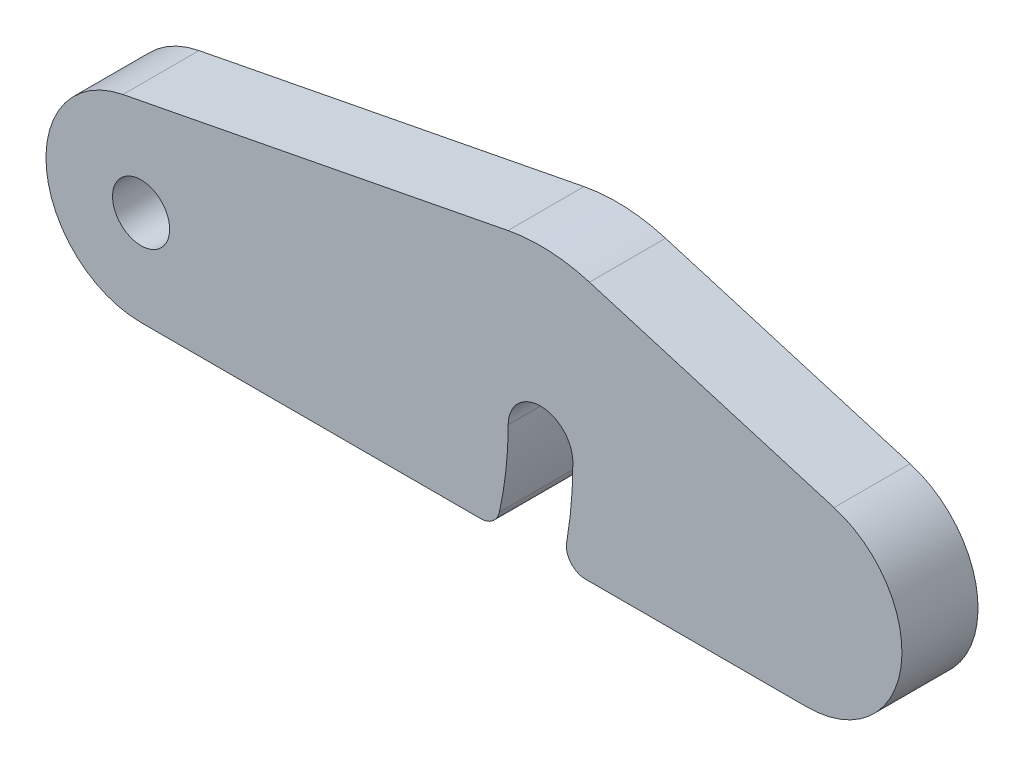
ISO-10303-21;
HEADER;
FILE_DESCRIPTION(('STEP AP214'),'2;1');
FILE_NAME('part.step','',(''),(''),'','','');
FILE_SCHEMA(('AUTOMOTIVE_DESIGN { 1 0 10303 214 1 1 1 1 }'));
ENDSEC;
DATA;
#1=APPLICATION_CONTEXT('core data for automotive mechanical design processes');
#2=APPLICATION_PROTOCOL_DEFINITION('international standard','automotive_design',2000,#1);
#3=PRODUCT_CONTEXT('',#1,'mechanical');
#4=PRODUCT('Part','Part','',(#3));
#5=PRODUCT_RELATED_PRODUCT_CATEGORY('part','',(#4));
#6=PRODUCT_DEFINITION_FORMATION('','',#4);
#7=PRODUCT_DEFINITION_CONTEXT('part definition',#1,'design');
#8=PRODUCT_DEFINITION('design','',#6,#7);
#9=PRODUCT_DEFINITION_SHAPE('','',#8);
#10=(LENGTH_UNIT() NAMED_UNIT(*) SI_UNIT(.MILLI.,.METRE.));
#11=(NAMED_UNIT(*) PLANE_ANGLE_UNIT() SI_UNIT($,.RADIAN.));
#12=(NAMED_UNIT(*) SI_UNIT($,.STERADIAN.) SOLID_ANGLE_UNIT());
#13=UNCERTAINTY_MEASURE_WITH_UNIT(LENGTH_MEASURE(1.E-05),#10,'distance_accuracy_value','');
#14=(GEOMETRIC_REPRESENTATION_CONTEXT(3) GLOBAL_UNCERTAINTY_ASSIGNED_CONTEXT((#13)) GLOBAL_UNIT_ASSIGNED_CONTEXT((#10,
#11,#12)) REPRESENTATION_CONTEXT('',''));
#15=CARTESIAN_POINT('',(0.,0.,0.));
#16=DIRECTION('',(0.,0.,1.));
#17=DIRECTION('',(1.,0.,0.));
#18=AXIS2_PLACEMENT_3D('',#15,#16,#17);
#19=CARTESIAN_POINT('',(-17.9761904761905,2.45422953905805,4.));
#20=DIRECTION('',(0.,0.,1.));
#21=DIRECTION('',(1.,0.,0.));
#22=AXIS2_PLACEMENT_3D('',#19,#20,#21);
#23=PLANE('',#22);
#24=CARTESIAN_POINT('',(-17.9761904761905,2.45422953905805,4.));
#25=DIRECTION('',(0.,0.,1.));
#26=DIRECTION('',(1.,0.,0.));
#27=AXIS2_PLACEMENT_3D('',#24,#25,#26);
#28=CIRCLE('',#27,1.5);
#29=CARTESIAN_POINT('',(-16.4761904761905,2.45422953905805,4.));
#30=VERTEX_POINT('',#29);
#31=EDGE_CURVE('E155',#30,#30,#28,.T.);
#32=ORIENTED_EDGE('',*,*,#31,.F.);
#33=EDGE_LOOP('',(#32));
#34=FACE_BOUND('',#33,.T.);
#35=CARTESIAN_POINT('',(-17.9761904761905,2.45422953905805,4.));
#36=DIRECTION('',(0.,0.,1.));
#37=DIRECTION('',(1.,0.,0.));
#38=AXIS2_PLACEMENT_3D('',#35,#36,#37);
#39=CIRCLE('',#38,22.7);
#40=CARTESIAN_POINT('',(4.39816371576224,-1.37699408963399,4.));
#41=VERTEX_POINT('',#40);
#42=CARTESIAN_POINT('',(4.72380952380953,2.45422953905805,4.));
#43=VERTEX_POINT('',#42);
#44=EDGE_CURVE('E142',#41,#43,#39,.T.);
#45=ORIENTED_EDGE('',*,*,#44,.F.);
#46=CARTESIAN_POINT('',(5.38381808545179,-1.545770460942,4.));
#47=DIRECTION('',(0.,0.,1.));
#48=DIRECTION('',(1.,0.,0.));
#49=AXIS2_PLACEMENT_3D('',#46,#47,#48);
#50=CIRCLE('',#49,1.);
#51=CARTESIAN_POINT('',(5.38381808545178,-2.545770460942,4.));
#52=VERTEX_POINT('',#51);
#53=EDGE_CURVE('E216',#41,#52,#50,.T.);
#54=ORIENTED_EDGE('',*,*,#53,.T.);
#55=DIRECTION('',(1.,0.,0.));
#56=VECTOR('',#55,1.);
#57=CARTESIAN_POINT('',(-17.9761904761905,-2.54577046094195,4.));
#58=LINE('',#57,#56);
#59=CARTESIAN_POINT('',(17.0238095238095,-2.54577046094203,4.));
#60=VERTEX_POINT('',#59);
#61=EDGE_CURVE('E164',#52,#60,#58,.T.);
#62=ORIENTED_EDGE('',*,*,#61,.T.);
#63=CARTESIAN_POINT('',(17.0238095238095,2.45422953905805,4.));
#64=DIRECTION('',(0.,0.,1.));
#65=DIRECTION('',(1.,0.,0.));
#66=AXIS2_PLACEMENT_3D('',#63,#64,#65);
#67=CIRCLE('',#66,5.00000000000008);
#68=CARTESIAN_POINT('',(18.452380952381,7.24580377655768,4.));
#69=VERTEX_POINT('',#68);
#70=EDGE_CURVE('E168',#60,#69,#67,.T.);
#71=ORIENTED_EDGE('',*,*,#70,.T.);
#72=DIRECTION('',(-0.95831484749991,0.285714285714286,0.));
#73=VECTOR('',#72,1.);
#74=CARTESIAN_POINT('',(18.452380952381,7.24580377655768,4.));
#75=LINE('',#74,#73);
#76=CARTESIAN_POINT('',(5.59523809523812,11.0790631665573,4.));
#77=VERTEX_POINT('',#76);
#78=EDGE_CURVE('E170',#69,#77,#75,.T.);
#79=ORIENTED_EDGE('',*,*,#78,.T.);
#80=CARTESIAN_POINT('',(3.02380952380953,2.45422953905805,4.));
#81=DIRECTION('',(0.,0.,1.));
#82=DIRECTION('',(1.,0.,0.));
#83=AXIS2_PLACEMENT_3D('',#80,#81,#82);
#84=CIRCLE('',#83,9.00000000000008);
#85=CARTESIAN_POINT('',(1.30952380952377,11.2894558796674,4.));
#86=VERTEX_POINT('',#85);
#87=EDGE_CURVE('E172',#77,#86,#84,.T.);
#88=ORIENTED_EDGE('',*,*,#87,.T.);
#89=DIRECTION('',(-0.981691815623252,-0.190476190476194,0.));
#90=VECTOR('',#89,1.);
#91=CARTESIAN_POINT('',(-18.9285714285714,7.36268861717431,4.));
#92=LINE('',#91,#90);
#93=CARTESIAN_POINT('',(-18.9285714285714,7.36268861717431,4.));
#94=VERTEX_POINT('',#93);
#95=EDGE_CURVE('E174',#86,#94,#92,.T.);
#96=ORIENTED_EDGE('',*,*,#95,.T.);
#97=CARTESIAN_POINT('',(-17.9761904761905,2.45422953905805,4.));
#98=DIRECTION('',(0.,0.,1.));
#99=DIRECTION('',(1.,0.,0.));
#100=AXIS2_PLACEMENT_3D('',#97,#98,#99);
#101=CIRCLE('',#100,5.);
#102=CARTESIAN_POINT('',(-17.9761904761905,-2.54577046094195,4.));
#103=VERTEX_POINT('',#102);
#104=EDGE_CURVE('E161',#94,#103,#101,.T.);
#105=ORIENTED_EDGE('',*,*,#104,.T.);
#106=CARTESIAN_POINT('',(-0.118699051021048,-2.54577046094199,4.));
#107=VERTEX_POINT('',#106);
#108=EDGE_CURVE('E166',#103,#107,#58,.T.);
#109=ORIENTED_EDGE('',*,*,#108,.T.);
#110=CARTESIAN_POINT('',(-0.118699051021045,-1.54577046094199,4.));
#111=DIRECTION('',(0.,0.,1.));
#112=DIRECTION('',(1.,0.,0.));
#113=AXIS2_PLACEMENT_3D('',#110,#111,#112);
#114=CIRCLE('',#113,1.);
#115=CARTESIAN_POINT('',(0.857120152540129,-1.76434969591467,4.));
#116=VERTEX_POINT('',#115);
#117=EDGE_CURVE('E51',#107,#116,#114,.T.);
#118=ORIENTED_EDGE('',*,*,#117,.T.);
#119=CARTESIAN_POINT('',(-17.9761904761905,2.45422953905805,4.));
#120=DIRECTION('',(0.,0.,-1.));
#121=DIRECTION('',(1.,0.,0.));
#122=AXIS2_PLACEMENT_3D('',#119,#120,#121);
#123=CIRCLE('',#122,19.3);
#124=CARTESIAN_POINT('',(1.32380952380953,2.45422953905805,4.));
#125=VERTEX_POINT('',#124);
#126=EDGE_CURVE('E231',#125,#116,#123,.T.);
#127=ORIENTED_EDGE('',*,*,#126,.F.);
#128=CARTESIAN_POINT('',(3.02380952380953,2.45422953905805,4.));
#129=DIRECTION('',(0.,0.,1.));
#130=DIRECTION('',(1.,0.,0.));
#131=AXIS2_PLACEMENT_3D('',#128,#129,#130);
#132=CIRCLE('',#131,1.7);
#133=EDGE_CURVE('E149',#43,#125,#132,.T.);
#134=ORIENTED_EDGE('',*,*,#133,.F.);
#135=EDGE_LOOP('',(#45,#54,#62,#71,#79,#88,#96,#105,#109,#118,#127,#134));
#136=FACE_BOUND('',#135,.T.);
#137=ADVANCED_FACE('F36',(#34,#136),#23,.T.);
#138=CARTESIAN_POINT('',(-17.9761904761905,2.45422953905805,0.));
#139=DIRECTION('',(0.,0.,1.));
#140=DIRECTION('',(1.,0.,0.));
#141=AXIS2_PLACEMENT_3D('',#138,#139,#140);
#142=PLANE('',#141);
#143=CARTESIAN_POINT('',(-17.9761904761905,2.45422953905805,0.));
#144=DIRECTION('',(0.,0.,1.));
#145=DIRECTION('',(1.,0.,0.));
#146=AXIS2_PLACEMENT_3D('',#143,#144,#145);
#147=CIRCLE('',#146,1.5);
#148=CARTESIAN_POINT('',(-16.4761904761905,2.45422953905805,0.));
#149=VERTEX_POINT('',#148);
#150=EDGE_CURVE('E151',#149,#149,#147,.T.);
#151=ORIENTED_EDGE('',*,*,#150,.T.);
#152=EDGE_LOOP('',(#151));
#153=FACE_BOUND('',#152,.T.);
#154=DIRECTION('',(1.,0.,0.));
#155=VECTOR('',#154,1.);
#156=CARTESIAN_POINT('',(-17.9761904761905,-2.54577046094195,0.));
#157=LINE('',#156,#155);
#158=CARTESIAN_POINT('',(5.38381808545178,-2.545770460942,0.));
#159=VERTEX_POINT('',#158);
#160=CARTESIAN_POINT('',(17.0238095238095,-2.54577046094203,0.));
#161=VERTEX_POINT('',#160);
#162=EDGE_CURVE('E179',#159,#161,#157,.T.);
#163=ORIENTED_EDGE('',*,*,#162,.F.);
#164=CARTESIAN_POINT('',(5.38381808545179,-1.545770460942,0.));
#165=DIRECTION('',(0.,0.,1.));
#166=DIRECTION('',(1.,0.,0.));
#167=AXIS2_PLACEMENT_3D('',#164,#165,#166);
#168=CIRCLE('',#167,1.);
#169=CARTESIAN_POINT('',(4.39816371576224,-1.37699408963399,0.));
#170=VERTEX_POINT('',#169);
#171=EDGE_CURVE('E132',#159,#170,#168,.F.);
#172=ORIENTED_EDGE('',*,*,#171,.T.);
#173=CARTESIAN_POINT('',(-17.9761904761905,2.45422953905805,0.));
#174=DIRECTION('',(0.,0.,1.));
#175=DIRECTION('',(1.,0.,0.));
#176=AXIS2_PLACEMENT_3D('',#173,#174,#175);
#177=CIRCLE('',#176,22.7);
#178=CARTESIAN_POINT('',(4.72380952380953,2.45422953905805,0.));
#179=VERTEX_POINT('',#178);
#180=EDGE_CURVE('E125',#170,#179,#177,.T.);
#181=ORIENTED_EDGE('',*,*,#180,.T.);
#182=CARTESIAN_POINT('',(3.02380952380953,2.45422953905805,0.));
#183=DIRECTION('',(0.,0.,1.));
#184=DIRECTION('',(1.,0.,0.));
#185=AXIS2_PLACEMENT_3D('',#182,#183,#184);
#186=CIRCLE('',#185,1.7);
#187=CARTESIAN_POINT('',(1.32380952380953,2.45422953905805,0.));
#188=VERTEX_POINT('',#187);
#189=EDGE_CURVE('E131',#179,#188,#186,.T.);
#190=ORIENTED_EDGE('',*,*,#189,.T.);
#191=CARTESIAN_POINT('',(-17.9761904761905,2.45422953905805,0.));
#192=DIRECTION('',(0.,0.,-1.));
#193=DIRECTION('',(1.,0.,0.));
#194=AXIS2_PLACEMENT_3D('',#191,#192,#193);
#195=CIRCLE('',#194,19.3);
#196=CARTESIAN_POINT('',(0.857120152540129,-1.76434969591467,0.));
#197=VERTEX_POINT('',#196);
#198=EDGE_CURVE('E136',#188,#197,#195,.T.);
#199=ORIENTED_EDGE('',*,*,#198,.T.);
#200=CARTESIAN_POINT('',(-0.118699051021045,-1.54577046094199,0.));
#201=DIRECTION('',(0.,0.,1.));
#202=DIRECTION('',(1.,0.,0.));
#203=AXIS2_PLACEMENT_3D('',#200,#201,#202);
#204=CIRCLE('',#203,1.);
#205=CARTESIAN_POINT('',(-0.118699051021048,-2.54577046094199,0.));
#206=VERTEX_POINT('',#205);
#207=EDGE_CURVE('E210',#197,#206,#204,.F.);
#208=ORIENTED_EDGE('',*,*,#207,.T.);
#209=CARTESIAN_POINT('',(-17.9761904761905,-2.54577046094195,0.));
#210=VERTEX_POINT('',#209);
#211=EDGE_CURVE('E180',#210,#206,#157,.T.);
#212=ORIENTED_EDGE('',*,*,#211,.F.);
#213=CARTESIAN_POINT('',(-17.9761904761905,2.45422953905805,0.));
#214=DIRECTION('',(0.,0.,1.));
#215=DIRECTION('',(1.,0.,0.));
#216=AXIS2_PLACEMENT_3D('',#213,#214,#215);
#217=CIRCLE('',#216,5.);
#218=CARTESIAN_POINT('',(-18.9285714285714,7.36268861717431,0.));
#219=VERTEX_POINT('',#218);
#220=EDGE_CURVE('E158',#219,#210,#217,.T.);
#221=ORIENTED_EDGE('',*,*,#220,.F.);
#222=DIRECTION('',(-0.981691815623252,-0.190476190476194,0.));
#223=VECTOR('',#222,1.);
#224=CARTESIAN_POINT('',(-18.9285714285714,7.36268861717431,0.));
#225=LINE('',#224,#223);
#226=CARTESIAN_POINT('',(1.30952380952377,11.2894558796674,0.));
#227=VERTEX_POINT('',#226);
#228=EDGE_CURVE('E165',#227,#219,#225,.T.);
#229=ORIENTED_EDGE('',*,*,#228,.F.);
#230=CARTESIAN_POINT('',(3.02380952380953,2.45422953905805,0.));
#231=DIRECTION('',(0.,0.,1.));
#232=DIRECTION('',(1.,0.,0.));
#233=AXIS2_PLACEMENT_3D('',#230,#231,#232);
#234=CIRCLE('',#233,9.00000000000008);
#235=CARTESIAN_POINT('',(5.59523809523812,11.0790631665573,0.));
#236=VERTEX_POINT('',#235);
#237=EDGE_CURVE('E187',#236,#227,#234,.T.);
#238=ORIENTED_EDGE('',*,*,#237,.F.);
#239=DIRECTION('',(-0.95831484749991,0.285714285714286,0.));
#240=VECTOR('',#239,1.);
#241=CARTESIAN_POINT('',(18.452380952381,7.24580377655768,0.));
#242=LINE('',#241,#240);
#243=CARTESIAN_POINT('',(18.452380952381,7.24580377655768,0.));
#244=VERTEX_POINT('',#243);
#245=EDGE_CURVE('E185',#244,#236,#242,.T.);
#246=ORIENTED_EDGE('',*,*,#245,.F.);
#247=CARTESIAN_POINT('',(17.0238095238095,2.45422953905805,0.));
#248=DIRECTION('',(0.,0.,1.));
#249=DIRECTION('',(1.,0.,0.));
#250=AXIS2_PLACEMENT_3D('',#247,#248,#249);
#251=CIRCLE('',#250,5.00000000000008);
#252=EDGE_CURVE('E183',#161,#244,#251,.T.);
#253=ORIENTED_EDGE('',*,*,#252,.F.);
#254=EDGE_LOOP('',(#163,#172,#181,#190,#199,#208,#212,#221,#229,#238,#246,#253));
#255=FACE_BOUND('',#254,.T.);
#256=ADVANCED_FACE('F128',(#153,#255),#142,.F.);
#257=CARTESIAN_POINT('',(-17.9761904761905,-2.54577046094195,4.));
#258=DIRECTION('',(0.,1.,0.));
#259=DIRECTION('',(-1.,0.,0.));
#260=AXIS2_PLACEMENT_3D('',#257,#258,#259);
#261=PLANE('',#260);
#262=ORIENTED_EDGE('',*,*,#61,.F.);
#263=DIRECTION('',(0.,0.,1.));
#264=VECTOR('',#263,1.);
#265=CARTESIAN_POINT('',(5.38381808545178,-2.545770460942,4.));
#266=LINE('',#265,#264);
#267=EDGE_CURVE('E207',#52,#159,#266,.F.);
#268=ORIENTED_EDGE('',*,*,#267,.T.);
#269=ORIENTED_EDGE('',*,*,#162,.T.);
#270=DIRECTION('',(0.,0.,-1.));
#271=VECTOR('',#270,1.);
#272=CARTESIAN_POINT('',(17.0238095238095,-2.54577046094203,4.));
#273=LINE('',#272,#271);
#274=EDGE_CURVE('E201',#60,#161,#273,.T.);
#275=ORIENTED_EDGE('',*,*,#274,.F.);
#276=EDGE_LOOP('',(#262,#268,#269,#275));
#277=FACE_BOUND('',#276,.T.);
#278=ADVANCED_FACE('F241',(#277),#261,.F.);
#279=CARTESIAN_POINT('',(3.02380952380953,2.45422953905805,4.));
#280=DIRECTION('',(0.,0.,-1.));
#281=DIRECTION('',(-1.,0.,0.));
#282=AXIS2_PLACEMENT_3D('',#279,#280,#281);
#283=CYLINDRICAL_SURFACE('',#282,1.7);
#284=ORIENTED_EDGE('',*,*,#189,.F.);
#285=DIRECTION('',(0.,0.,1.));
#286=VECTOR('',#285,1.);
#287=CARTESIAN_POINT('',(4.72380952380953,2.45422953905805,0.));
#288=LINE('',#287,#286);
#289=EDGE_CURVE('E139',#179,#43,#288,.T.);
#290=ORIENTED_EDGE('',*,*,#289,.T.);
#291=ORIENTED_EDGE('',*,*,#133,.T.);
#292=DIRECTION('',(0.,0.,1.));
#293=VECTOR('',#292,1.);
#294=CARTESIAN_POINT('',(1.32380952380953,2.45422953905805,0.));
#295=LINE('',#294,#293);
#296=EDGE_CURVE('E135',#188,#125,#295,.T.);
#297=ORIENTED_EDGE('',*,*,#296,.F.);
#298=EDGE_LOOP('',(#284,#290,#291,#297));
#299=FACE_BOUND('',#298,.T.);
#300=ADVANCED_FACE('F148',(#299),#283,.F.);
#301=CARTESIAN_POINT('',(-17.9761904761905,2.45422953905805,4.));
#302=DIRECTION('',(0.,0.,-1.));
#303=DIRECTION('',(-1.,0.,0.));
#304=AXIS2_PLACEMENT_3D('',#301,#302,#303);
#305=CYLINDRICAL_SURFACE('',#304,5.);
#306=ORIENTED_EDGE('',*,*,#220,.T.);
#307=DIRECTION('',(0.,0.,-1.));
#308=VECTOR('',#307,1.);
#309=CARTESIAN_POINT('',(-17.9761904761905,-2.54577046094195,4.));
#310=LINE('',#309,#308);
#311=EDGE_CURVE('E204',#103,#210,#310,.T.);
#312=ORIENTED_EDGE('',*,*,#311,.F.);
#313=ORIENTED_EDGE('',*,*,#104,.F.);
#314=DIRECTION('',(0.,0.,-1.));
#315=VECTOR('',#314,1.);
#316=CARTESIAN_POINT('',(-18.9285714285714,7.36268861717431,4.));
#317=LINE('',#316,#315);
#318=EDGE_CURVE('E176',#94,#219,#317,.T.);
#319=ORIENTED_EDGE('',*,*,#318,.T.);
#320=EDGE_LOOP('',(#306,#312,#313,#319));
#321=FACE_BOUND('',#320,.T.);
#322=ADVANCED_FACE('F225',(#321),#305,.T.);
#323=ORIENTED_EDGE('',*,*,#211,.T.);
#324=DIRECTION('',(0.,0.,1.));
#325=VECTOR('',#324,1.);
#326=CARTESIAN_POINT('',(-0.118699051021048,-2.54577046094199,4.));
#327=LINE('',#326,#325);
#328=EDGE_CURVE('E44',#206,#107,#327,.T.);
#329=ORIENTED_EDGE('',*,*,#328,.T.);
#330=ORIENTED_EDGE('',*,*,#108,.F.);
#331=ORIENTED_EDGE('',*,*,#311,.T.);
#332=EDGE_LOOP('',(#323,#329,#330,#331));
#333=FACE_BOUND('',#332,.T.);
#334=ADVANCED_FACE('F218',(#333),#261,.F.);
#335=CARTESIAN_POINT('',(17.0238095238095,2.45422953905805,4.));
#336=DIRECTION('',(0.,0.,-1.));
#337=DIRECTION('',(-1.,0.,0.));
#338=AXIS2_PLACEMENT_3D('',#335,#336,#337);
#339=CYLINDRICAL_SURFACE('',#338,5.00000000000008);
#340=ORIENTED_EDGE('',*,*,#252,.T.);
#341=DIRECTION('',(0.,0.,-1.));
#342=VECTOR('',#341,1.);
#343=CARTESIAN_POINT('',(18.452380952381,7.24580377655768,4.));
#344=LINE('',#343,#342);
#345=EDGE_CURVE('E198',#69,#244,#344,.T.);
#346=ORIENTED_EDGE('',*,*,#345,.F.);
#347=ORIENTED_EDGE('',*,*,#70,.F.);
#348=ORIENTED_EDGE('',*,*,#274,.T.);
#349=EDGE_LOOP('',(#340,#346,#347,#348));
#350=FACE_BOUND('',#349,.T.);
#351=ADVANCED_FACE('F247',(#350),#339,.T.);
#352=CARTESIAN_POINT('',(18.452380952381,7.24580377655768,4.));
#353=DIRECTION('',(-0.285714285714286,-0.95831484749991,0.));
#354=DIRECTION('',(0.95831484749991,-0.285714285714286,0.));
#355=AXIS2_PLACEMENT_3D('',#352,#353,#354);
#356=PLANE('',#355);
#357=ORIENTED_EDGE('',*,*,#245,.T.);
#358=DIRECTION('',(0.,0.,-1.));
#359=VECTOR('',#358,1.);
#360=CARTESIAN_POINT('',(5.59523809523812,11.0790631665573,4.));
#361=LINE('',#360,#359);
#362=EDGE_CURVE('E195',#77,#236,#361,.T.);
#363=ORIENTED_EDGE('',*,*,#362,.F.);
#364=ORIENTED_EDGE('',*,*,#78,.F.);
#365=ORIENTED_EDGE('',*,*,#345,.T.);
#366=EDGE_LOOP('',(#357,#363,#364,#365));
#367=FACE_BOUND('',#366,.T.);
#368=ADVANCED_FACE('F251',(#367),#356,.F.);
#369=CARTESIAN_POINT('',(3.02380952380953,2.45422953905805,4.));
#370=DIRECTION('',(0.,0.,-1.));
#371=DIRECTION('',(-1.,0.,0.));
#372=AXIS2_PLACEMENT_3D('',#369,#370,#371);
#373=CYLINDRICAL_SURFACE('',#372,9.00000000000008);
#374=ORIENTED_EDGE('',*,*,#237,.T.);
#375=DIRECTION('',(0.,0.,-1.));
#376=VECTOR('',#375,1.);
#377=CARTESIAN_POINT('',(1.30952380952377,11.2894558796674,4.));
#378=LINE('',#377,#376);
#379=EDGE_CURVE('E192',#86,#227,#378,.T.);
#380=ORIENTED_EDGE('',*,*,#379,.F.);
#381=ORIENTED_EDGE('',*,*,#87,.F.);
#382=ORIENTED_EDGE('',*,*,#362,.T.);
#383=EDGE_LOOP('',(#374,#380,#381,#382));
#384=FACE_BOUND('',#383,.T.);
#385=ADVANCED_FACE('F256',(#384),#373,.T.);
#386=CARTESIAN_POINT('',(-18.9285714285714,7.36268861717431,4.));
#387=DIRECTION('',(0.190476190476194,-0.981691815623252,0.));
#388=DIRECTION('',(0.981691815623252,0.190476190476194,0.));
#389=AXIS2_PLACEMENT_3D('',#386,#387,#388);
#390=PLANE('',#389);
#391=ORIENTED_EDGE('',*,*,#228,.T.);
#392=ORIENTED_EDGE('',*,*,#318,.F.);
#393=ORIENTED_EDGE('',*,*,#95,.F.);
#394=ORIENTED_EDGE('',*,*,#379,.T.);
#395=EDGE_LOOP('',(#391,#392,#393,#394));
#396=FACE_BOUND('',#395,.T.);
#397=ADVANCED_FACE('F258',(#396),#390,.F.);
#398=CARTESIAN_POINT('',(-17.9761904761905,2.45422953905805,4.));
#399=DIRECTION('',(0.,0.,-1.));
#400=DIRECTION('',(-1.,0.,0.));
#401=AXIS2_PLACEMENT_3D('',#398,#399,#400);
#402=CYLINDRICAL_SURFACE('',#401,1.5);
#403=ORIENTED_EDGE('',*,*,#31,.T.);
#404=EDGE_LOOP('',(#403));
#405=FACE_BOUND('',#404,.T.);
#406=ORIENTED_EDGE('',*,*,#150,.F.);
#407=EDGE_LOOP('',(#406));
#408=FACE_BOUND('',#407,.T.);
#409=ADVANCED_FACE('F260',(#405,#408),#402,.F.);
#410=CARTESIAN_POINT('',(-17.9761904761905,2.45422953905805,0.));
#411=DIRECTION('',(0.,0.,1.));
#412=DIRECTION('',(1.,0.,0.));
#413=AXIS2_PLACEMENT_3D('',#410,#411,#412);
#414=CYLINDRICAL_SURFACE('',#413,19.3);
#415=ORIENTED_EDGE('',*,*,#126,.T.);
#416=DIRECTION('',(0.,0.,1.));
#417=VECTOR('',#416,1.);
#418=CARTESIAN_POINT('',(0.857120152540129,-1.76434969591467,0.));
#419=LINE('',#418,#417);
#420=EDGE_CURVE('E11',#116,#197,#419,.F.);
#421=ORIENTED_EDGE('',*,*,#420,.T.);
#422=ORIENTED_EDGE('',*,*,#198,.F.);
#423=ORIENTED_EDGE('',*,*,#296,.T.);
#424=EDGE_LOOP('',(#415,#421,#422,#423));
#425=FACE_BOUND('',#424,.T.);
#426=ADVANCED_FACE('F230',(#425),#414,.T.);
#427=CARTESIAN_POINT('',(-17.9761904761905,2.45422953905805,0.));
#428=DIRECTION('',(0.,0.,1.));
#429=DIRECTION('',(1.,0.,0.));
#430=AXIS2_PLACEMENT_3D('',#427,#428,#429);
#431=CYLINDRICAL_SURFACE('',#430,22.7);
#432=ORIENTED_EDGE('',*,*,#180,.F.);
#433=DIRECTION('',(0.,0.,1.));
#434=VECTOR('',#433,1.);
#435=CARTESIAN_POINT('',(4.39816371576224,-1.37699408963399,0.));
#436=LINE('',#435,#434);
#437=EDGE_CURVE('E213',#170,#41,#436,.T.);
#438=ORIENTED_EDGE('',*,*,#437,.T.);
#439=ORIENTED_EDGE('',*,*,#44,.T.);
#440=ORIENTED_EDGE('',*,*,#289,.F.);
#441=EDGE_LOOP('',(#432,#438,#439,#440));
#442=FACE_BOUND('',#441,.T.);
#443=ADVANCED_FACE('F140',(#442),#431,.F.);
#444=CARTESIAN_POINT('',(5.38381808545179,-1.545770460942,0.));
#445=DIRECTION('',(0.,0.,1.));
#446=DIRECTION('',(1.,0.,0.));
#447=AXIS2_PLACEMENT_3D('',#444,#445,#446);
#448=CYLINDRICAL_SURFACE('',#447,1.);
#449=ORIENTED_EDGE('',*,*,#53,.F.);
#450=ORIENTED_EDGE('',*,*,#437,.F.);
#451=ORIENTED_EDGE('',*,*,#171,.F.);
#452=ORIENTED_EDGE('',*,*,#267,.F.);
#453=EDGE_LOOP('',(#449,#450,#451,#452));
#454=FACE_BOUND('',#453,.T.);
#455=ADVANCED_FACE('F239',(#454),#448,.T.);
#456=CARTESIAN_POINT('',(-0.118699051021045,-1.54577046094199,0.));
#457=DIRECTION('',(0.,0.,1.));
#458=DIRECTION('',(1.,0.,0.));
#459=AXIS2_PLACEMENT_3D('',#456,#457,#458);
#460=CYLINDRICAL_SURFACE('',#459,1.);
#461=ORIENTED_EDGE('',*,*,#207,.F.);
#462=ORIENTED_EDGE('',*,*,#420,.F.);
#463=ORIENTED_EDGE('',*,*,#117,.F.);
#464=ORIENTED_EDGE('',*,*,#328,.F.);
#465=EDGE_LOOP('',(#461,#462,#463,#464));
#466=FACE_BOUND('',#465,.T.);
#467=ADVANCED_FACE('F38',(#466),#460,.T.);
#468=CLOSED_SHELL('',(#137,#256,#278,#300,#322,#334,#351,#368,#385,#397,#409,#426,#443,#455,#467));
#469=MANIFOLD_SOLID_BREP('B2',#468);
#470=ADVANCED_BREP_SHAPE_REPRESENTATION('',(#18,#469),#14);
#471=SHAPE_DEFINITION_REPRESENTATION(#9,#470);
ENDSEC;
END-ISO-10303-21;
